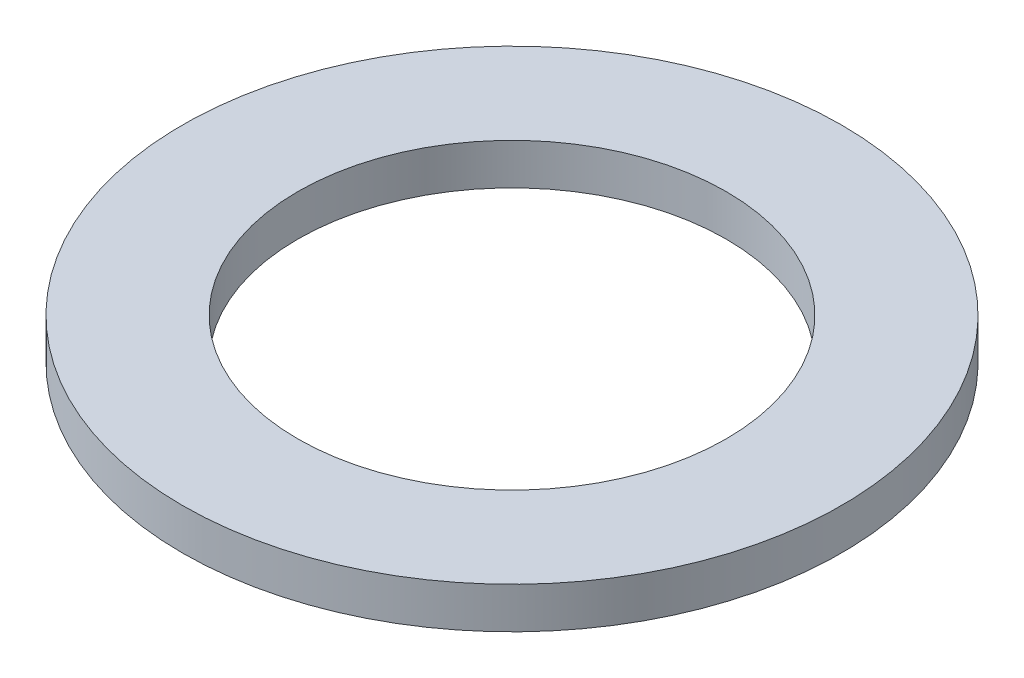
ISO-10303-21;
HEADER;
FILE_DESCRIPTION(('STEP AP214'),'2;1');
FILE_NAME('part.step','',(''),(''),'','','');
FILE_SCHEMA(('AUTOMOTIVE_DESIGN { 1 0 10303 214 1 1 1 1 }'));
ENDSEC;
DATA;
#1=APPLICATION_CONTEXT('core data for automotive mechanical design processes');
#2=APPLICATION_PROTOCOL_DEFINITION('international standard','automotive_design',2000,#1);
#3=PRODUCT_CONTEXT('',#1,'mechanical');
#4=PRODUCT('Part','Part','',(#3));
#5=PRODUCT_RELATED_PRODUCT_CATEGORY('part','',(#4));
#6=PRODUCT_DEFINITION_FORMATION('','',#4);
#7=PRODUCT_DEFINITION_CONTEXT('part definition',#1,'design');
#8=PRODUCT_DEFINITION('design','',#6,#7);
#9=PRODUCT_DEFINITION_SHAPE('','',#8);
#10=(LENGTH_UNIT() NAMED_UNIT(*) SI_UNIT(.MILLI.,.METRE.));
#11=(NAMED_UNIT(*) PLANE_ANGLE_UNIT() SI_UNIT($,.RADIAN.));
#12=(NAMED_UNIT(*) SI_UNIT($,.STERADIAN.) SOLID_ANGLE_UNIT());
#13=UNCERTAINTY_MEASURE_WITH_UNIT(LENGTH_MEASURE(1.E-05),#10,'distance_accuracy_value','');
#14=(GEOMETRIC_REPRESENTATION_CONTEXT(3) GLOBAL_UNCERTAINTY_ASSIGNED_CONTEXT((#13)) GLOBAL_UNIT_ASSIGNED_CONTEXT((#10,
#11,#12)) REPRESENTATION_CONTEXT('',''));
#15=CARTESIAN_POINT('',(0.,0.,0.));
#16=DIRECTION('',(0.,0.,1.));
#17=DIRECTION('',(1.,0.,0.));
#18=AXIS2_PLACEMENT_3D('',#15,#16,#17);
#19=CARTESIAN_POINT('',(0.,0.5,0.));
#20=DIRECTION('',(0.,1.,0.));
#21=DIRECTION('',(0.,0.,1.));
#22=AXIS2_PLACEMENT_3D('',#19,#20,#21);
#23=PLANE('',#22);
#24=CARTESIAN_POINT('',(0.,0.5,0.));
#25=DIRECTION('',(0.,1.,0.));
#26=DIRECTION('',(0.,0.,1.));
#27=AXIS2_PLACEMENT_3D('',#24,#25,#26);
#28=CIRCLE('',#27,4.);
#29=CARTESIAN_POINT('',(0.,0.5,4.));
#30=VERTEX_POINT('',#29);
#31=EDGE_CURVE('E10',#30,#30,#28,.T.);
#32=ORIENTED_EDGE('',*,*,#31,.T.);
#33=EDGE_LOOP('',(#32));
#34=FACE_BOUND('',#33,.T.);
#35=CARTESIAN_POINT('',(0.,0.5,0.));
#36=DIRECTION('',(0.,1.,0.));
#37=DIRECTION('',(0.,0.,1.));
#38=AXIS2_PLACEMENT_3D('',#35,#36,#37);
#39=CIRCLE('',#38,2.6);
#40=CARTESIAN_POINT('',(0.,0.5,2.6));
#41=VERTEX_POINT('',#40);
#42=EDGE_CURVE('E43',#41,#41,#39,.T.);
#43=ORIENTED_EDGE('',*,*,#42,.F.);
#44=EDGE_LOOP('',(#43));
#45=FACE_BOUND('',#44,.T.);
#46=ADVANCED_FACE('F32',(#34,#45),#23,.T.);
#47=CARTESIAN_POINT('',(0.,0.,0.));
#48=DIRECTION('',(0.,1.,0.));
#49=DIRECTION('',(0.,0.,1.));
#50=AXIS2_PLACEMENT_3D('',#47,#48,#49);
#51=PLANE('',#50);
#52=CARTESIAN_POINT('',(0.,0.,0.));
#53=DIRECTION('',(0.,1.,0.));
#54=DIRECTION('',(0.,0.,1.));
#55=AXIS2_PLACEMENT_3D('',#52,#53,#54);
#56=CIRCLE('',#55,4.);
#57=CARTESIAN_POINT('',(0.,0.,4.));
#58=VERTEX_POINT('',#57);
#59=EDGE_CURVE('E36',#58,#58,#56,.T.);
#60=ORIENTED_EDGE('',*,*,#59,.F.);
#61=EDGE_LOOP('',(#60));
#62=FACE_BOUND('',#61,.T.);
#63=CARTESIAN_POINT('',(0.,0.,0.));
#64=DIRECTION('',(0.,1.,0.));
#65=DIRECTION('',(0.,0.,1.));
#66=AXIS2_PLACEMENT_3D('',#63,#64,#65);
#67=CIRCLE('',#66,2.6);
#68=CARTESIAN_POINT('',(0.,0.,2.6));
#69=VERTEX_POINT('',#68);
#70=EDGE_CURVE('E45',#69,#69,#67,.T.);
#71=ORIENTED_EDGE('',*,*,#70,.T.);
#72=EDGE_LOOP('',(#71));
#73=FACE_BOUND('',#72,.T.);
#74=ADVANCED_FACE('F55',(#62,#73),#51,.F.);
#75=CARTESIAN_POINT('',(0.,0.5,0.));
#76=DIRECTION('',(0.,-1.,0.));
#77=DIRECTION('',(0.,0.,-1.));
#78=AXIS2_PLACEMENT_3D('',#75,#76,#77);
#79=CYLINDRICAL_SURFACE('',#78,4.);
#80=ORIENTED_EDGE('',*,*,#31,.F.);
#81=EDGE_LOOP('',(#80));
#82=FACE_BOUND('',#81,.T.);
#83=ORIENTED_EDGE('',*,*,#59,.T.);
#84=EDGE_LOOP('',(#83));
#85=FACE_BOUND('',#84,.T.);
#86=ADVANCED_FACE('F34',(#82,#85),#79,.T.);
#87=CARTESIAN_POINT('',(0.,0.5,0.));
#88=DIRECTION('',(0.,-1.,0.));
#89=DIRECTION('',(0.,0.,-1.));
#90=AXIS2_PLACEMENT_3D('',#87,#88,#89);
#91=CYLINDRICAL_SURFACE('',#90,2.6);
#92=ORIENTED_EDGE('',*,*,#42,.T.);
#93=EDGE_LOOP('',(#92));
#94=FACE_BOUND('',#93,.T.);
#95=ORIENTED_EDGE('',*,*,#70,.F.);
#96=EDGE_LOOP('',(#95));
#97=FACE_BOUND('',#96,.T.);
#98=ADVANCED_FACE('F51',(#94,#97),#91,.F.);
#99=CLOSED_SHELL('',(#46,#74,#86,#98));
#100=MANIFOLD_SOLID_BREP('B2',#99);
#101=ADVANCED_BREP_SHAPE_REPRESENTATION('',(#18,#100),#14);
#102=SHAPE_DEFINITION_REPRESENTATION(#9,#101);
ENDSEC;
END-ISO-10303-21;
